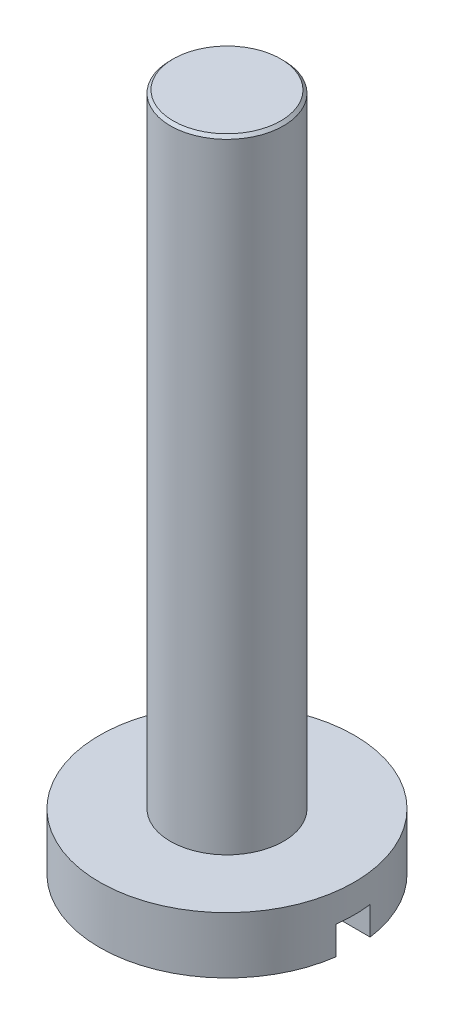
ISO-10303-21;
HEADER;
FILE_DESCRIPTION(('STEP AP214'),'2;1');
FILE_NAME('part.step','',(''),(''),'','','');
FILE_SCHEMA(('AUTOMOTIVE_DESIGN { 1 0 10303 214 1 1 1 1 }'));
ENDSEC;
DATA;
#1=APPLICATION_CONTEXT('core data for automotive mechanical design processes');
#2=APPLICATION_PROTOCOL_DEFINITION('international standard','automotive_design',2000,#1);
#3=PRODUCT_CONTEXT('',#1,'mechanical');
#4=PRODUCT('Part','Part','',(#3));
#5=PRODUCT_RELATED_PRODUCT_CATEGORY('part','',(#4));
#6=PRODUCT_DEFINITION_FORMATION('','',#4);
#7=PRODUCT_DEFINITION_CONTEXT('part definition',#1,'design');
#8=PRODUCT_DEFINITION('design','',#6,#7);
#9=PRODUCT_DEFINITION_SHAPE('','',#8);
#10=(LENGTH_UNIT() NAMED_UNIT(*) SI_UNIT(.MILLI.,.METRE.));
#11=(NAMED_UNIT(*) PLANE_ANGLE_UNIT() SI_UNIT($,.RADIAN.));
#12=(NAMED_UNIT(*) SI_UNIT($,.STERADIAN.) SOLID_ANGLE_UNIT());
#13=UNCERTAINTY_MEASURE_WITH_UNIT(LENGTH_MEASURE(1.E-05),#10,'distance_accuracy_value','');
#14=(GEOMETRIC_REPRESENTATION_CONTEXT(3) GLOBAL_UNCERTAINTY_ASSIGNED_CONTEXT((#13)) GLOBAL_UNIT_ASSIGNED_CONTEXT((#10,
#11,#12)) REPRESENTATION_CONTEXT('',''));
#15=CARTESIAN_POINT('',(0.,0.,0.));
#16=DIRECTION('',(0.,0.,1.));
#17=DIRECTION('',(1.,0.,0.));
#18=AXIS2_PLACEMENT_3D('',#15,#16,#17);
#19=CARTESIAN_POINT('',(0.,-1.,0.));
#20=DIRECTION('',(0.,-1.,0.));
#21=DIRECTION('',(0.,0.,-1.));
#22=AXIS2_PLACEMENT_3D('',#19,#20,#21);
#23=PLANE('',#22);
#24=DIRECTION('',(1.,0.,0.));
#25=VECTOR('',#24,1.);
#26=CARTESIAN_POINT('',(0.,-1.,-0.3));
#27=LINE('',#26,#25);
#28=CARTESIAN_POINT('',(-2.22991031209778,-1.,-0.3));
#29=VERTEX_POINT('',#28);
#30=CARTESIAN_POINT('',(2.22991031209778,-1.,-0.3));
#31=VERTEX_POINT('',#30);
#32=EDGE_CURVE('E91',#29,#31,#27,.T.);
#33=ORIENTED_EDGE('',*,*,#32,.F.);
#34=CARTESIAN_POINT('',(0.,-1.,0.));
#35=DIRECTION('',(0.,-1.,0.));
#36=DIRECTION('',(0.,0.,-1.));
#37=AXIS2_PLACEMENT_3D('',#34,#35,#36);
#38=CIRCLE('',#37,2.25);
#39=EDGE_CURVE('E101',#29,#31,#38,.T.);
#40=ORIENTED_EDGE('',*,*,#39,.T.);
#41=EDGE_LOOP('',(#33,#40));
#42=FACE_BOUND('',#41,.T.);
#43=ADVANCED_FACE('F43',(#42),#23,.T.);
#44=CARTESIAN_POINT('',(0.,-1.,0.));
#45=DIRECTION('',(0.,1.,0.));
#46=DIRECTION('',(0.,0.,1.));
#47=AXIS2_PLACEMENT_3D('',#44,#45,#46);
#48=CYLINDRICAL_SURFACE('',#47,2.25);
#49=CARTESIAN_POINT('',(0.,-0.5,0.));
#50=DIRECTION('',(0.,1.,0.));
#51=DIRECTION('',(0.,0.,1.));
#52=AXIS2_PLACEMENT_3D('',#49,#50,#51);
#53=CIRCLE('',#52,2.25);
#54=CARTESIAN_POINT('',(2.22991031209778,-0.5,0.3));
#55=VERTEX_POINT('',#54);
#56=CARTESIAN_POINT('',(2.22991031209778,-0.5,-0.3));
#57=VERTEX_POINT('',#56);
#58=EDGE_CURVE('E12',#55,#57,#53,.T.);
#59=ORIENTED_EDGE('',*,*,#58,.T.);
#60=DIRECTION('',(0.,1.,0.));
#61=VECTOR('',#60,1.);
#62=CARTESIAN_POINT('',(2.22991031209778,-1.,-0.3));
#63=LINE('',#62,#61);
#64=EDGE_CURVE('E66',#57,#31,#63,.F.);
#65=ORIENTED_EDGE('',*,*,#64,.T.);
#66=ORIENTED_EDGE('',*,*,#39,.F.);
#67=DIRECTION('',(0.,1.,0.));
#68=VECTOR('',#67,1.);
#69=CARTESIAN_POINT('',(-2.22991031209778,-1.,-0.3));
#70=LINE('',#69,#68);
#71=CARTESIAN_POINT('',(-2.22991031209778,-0.5,-0.3));
#72=VERTEX_POINT('',#71);
#73=EDGE_CURVE('E107',#29,#72,#70,.T.);
#74=ORIENTED_EDGE('',*,*,#73,.T.);
#75=CARTESIAN_POINT('',(-2.22991031209778,-0.5,0.3));
#76=VERTEX_POINT('',#75);
#77=EDGE_CURVE('E47',#72,#76,#53,.T.);
#78=ORIENTED_EDGE('',*,*,#77,.T.);
#79=DIRECTION('',(0.,1.,0.));
#80=VECTOR('',#79,1.);
#81=CARTESIAN_POINT('',(-2.22991031209778,-1.,0.3));
#82=LINE('',#81,#80);
#83=CARTESIAN_POINT('',(-2.22991031209778,-1.,0.3));
#84=VERTEX_POINT('',#83);
#85=EDGE_CURVE('E86',#76,#84,#82,.F.);
#86=ORIENTED_EDGE('',*,*,#85,.T.);
#87=CARTESIAN_POINT('',(2.22991031209778,-1.,0.3));
#88=VERTEX_POINT('',#87);
#89=EDGE_CURVE('E92',#88,#84,#38,.T.);
#90=ORIENTED_EDGE('',*,*,#89,.F.);
#91=DIRECTION('',(0.,1.,0.));
#92=VECTOR('',#91,1.);
#93=CARTESIAN_POINT('',(2.22991031209778,-1.,0.3));
#94=LINE('',#93,#92);
#95=EDGE_CURVE('E58',#88,#55,#94,.T.);
#96=ORIENTED_EDGE('',*,*,#95,.T.);
#97=EDGE_LOOP('',(#59,#65,#66,#74,#78,#86,#90,#96));
#98=FACE_BOUND('',#97,.T.);
#99=CARTESIAN_POINT('',(0.,0.,0.));
#100=DIRECTION('',(0.,-1.,0.));
#101=DIRECTION('',(0.,0.,-1.));
#102=AXIS2_PLACEMENT_3D('',#99,#100,#101);
#103=CIRCLE('',#102,2.25);
#104=CARTESIAN_POINT('',(0.,0.,-2.25));
#105=VERTEX_POINT('',#104);
#106=EDGE_CURVE('E104',#105,#105,#103,.T.);
#107=ORIENTED_EDGE('',*,*,#106,.T.);
#108=EDGE_LOOP('',(#107));
#109=FACE_BOUND('',#108,.T.);
#110=ADVANCED_FACE('F45',(#98,#109),#48,.T.);
#111=DIRECTION('',(-1.,0.,0.));
#112=VECTOR('',#111,1.);
#113=CARTESIAN_POINT('',(0.,-1.,0.3));
#114=LINE('',#113,#112);
#115=EDGE_CURVE('E83',#88,#84,#114,.T.);
#116=ORIENTED_EDGE('',*,*,#115,.F.);
#117=ORIENTED_EDGE('',*,*,#89,.T.);
#118=EDGE_LOOP('',(#116,#117));
#119=FACE_BOUND('',#118,.T.);
#120=ADVANCED_FACE('F100',(#119),#23,.T.);
#121=CARTESIAN_POINT('',(0.,0.,0.));
#122=DIRECTION('',(0.,-1.,0.));
#123=DIRECTION('',(0.,0.,-1.));
#124=AXIS2_PLACEMENT_3D('',#121,#122,#123);
#125=PLANE('',#124);
#126=ORIENTED_EDGE('',*,*,#106,.F.);
#127=EDGE_LOOP('',(#126));
#128=FACE_BOUND('',#127,.T.);
#129=ADVANCED_FACE('F121',(#128),#125,.F.);
#130=CARTESIAN_POINT('',(0.,-0.5,0.));
#131=DIRECTION('',(0.,1.,0.));
#132=DIRECTION('',(0.,0.,1.));
#133=AXIS2_PLACEMENT_3D('',#130,#131,#132);
#134=PLANE('',#133);
#135=DIRECTION('',(-1.,0.,0.));
#136=VECTOR('',#135,1.);
#137=CARTESIAN_POINT('',(-4.09817586391625,-0.5,0.3));
#138=LINE('',#137,#136);
#139=EDGE_CURVE('E172',#55,#76,#138,.T.);
#140=ORIENTED_EDGE('',*,*,#139,.T.);
#141=ORIENTED_EDGE('',*,*,#77,.F.);
#142=DIRECTION('',(1.,0.,0.));
#143=VECTOR('',#142,1.);
#144=CARTESIAN_POINT('',(-4.09817586391625,-0.5,-0.3));
#145=LINE('',#144,#143);
#146=EDGE_CURVE('E98',#72,#57,#145,.T.);
#147=ORIENTED_EDGE('',*,*,#146,.T.);
#148=ORIENTED_EDGE('',*,*,#58,.F.);
#149=EDGE_LOOP('',(#140,#141,#147,#148));
#150=FACE_BOUND('',#149,.T.);
#151=ADVANCED_FACE('F125',(#150),#134,.F.);
#152=CARTESIAN_POINT('',(-4.09817586391625,-0.5,-0.3));
#153=DIRECTION('',(0.,0.,-1.));
#154=DIRECTION('',(-1.,0.,0.));
#155=AXIS2_PLACEMENT_3D('',#152,#153,#154);
#156=PLANE('',#155);
#157=ORIENTED_EDGE('',*,*,#32,.T.);
#158=ORIENTED_EDGE('',*,*,#64,.F.);
#159=ORIENTED_EDGE('',*,*,#146,.F.);
#160=ORIENTED_EDGE('',*,*,#73,.F.);
#161=EDGE_LOOP('',(#157,#158,#159,#160));
#162=FACE_BOUND('',#161,.T.);
#163=ADVANCED_FACE('F111',(#162),#156,.F.);
#164=CARTESIAN_POINT('',(-4.09817586391625,-0.5,0.3));
#165=DIRECTION('',(0.,0.,1.));
#166=DIRECTION('',(1.,0.,0.));
#167=AXIS2_PLACEMENT_3D('',#164,#165,#166);
#168=PLANE('',#167);
#169=ORIENTED_EDGE('',*,*,#115,.T.);
#170=ORIENTED_EDGE('',*,*,#85,.F.);
#171=ORIENTED_EDGE('',*,*,#139,.F.);
#172=ORIENTED_EDGE('',*,*,#95,.F.);
#173=EDGE_LOOP('',(#169,#170,#171,#172));
#174=FACE_BOUND('',#173,.T.);
#175=ADVANCED_FACE('F85',(#174),#168,.F.);
#176=CLOSED_SHELL('',(#43,#110,#120,#129,#151,#163,#175));
#177=MANIFOLD_SOLID_BREP('B2',#176);
#178=CARTESIAN_POINT('',(0.,11.,0.));
#179=DIRECTION('',(0.,-1.,0.));
#180=DIRECTION('',(0.,0.,-1.));
#181=AXIS2_PLACEMENT_3D('',#178,#179,#180);
#182=CYLINDRICAL_SURFACE('',#181,1.);
#183=CARTESIAN_POINT('',(0.,10.95,0.));
#184=DIRECTION('',(0.,1.,0.));
#185=DIRECTION('',(0.,0.,1.));
#186=AXIS2_PLACEMENT_3D('',#183,#184,#185);
#187=CIRCLE('',#186,1.);
#188=CARTESIAN_POINT('',(0.,10.95,1.));
#189=VERTEX_POINT('',#188);
#190=EDGE_CURVE('E42',#189,#189,#187,.F.);
#191=ORIENTED_EDGE('',*,*,#190,.T.);
#192=EDGE_LOOP('',(#191));
#193=FACE_BOUND('',#192,.T.);
#194=CARTESIAN_POINT('',(0.,0.,0.));
#195=DIRECTION('',(0.,1.,0.));
#196=DIRECTION('',(0.,0.,1.));
#197=AXIS2_PLACEMENT_3D('',#194,#195,#196);
#198=CIRCLE('',#197,1.);
#199=CARTESIAN_POINT('',(0.,0.,1.));
#200=VERTEX_POINT('',#199);
#201=EDGE_CURVE('E190',#200,#200,#198,.T.);
#202=ORIENTED_EDGE('',*,*,#201,.T.);
#203=EDGE_LOOP('',(#202));
#204=FACE_BOUND('',#203,.T.);
#205=ADVANCED_FACE('F179',(#193,#204),#182,.T.);
#206=CARTESIAN_POINT('',(0.,11.,0.));
#207=DIRECTION('',(0.,1.,0.));
#208=DIRECTION('',(0.,0.,1.));
#209=AXIS2_PLACEMENT_3D('',#206,#207,#208);
#210=PLANE('',#209);
#211=CARTESIAN_POINT('',(0.,11.,0.));
#212=DIRECTION('',(0.,1.,0.));
#213=DIRECTION('',(0.,0.,1.));
#214=AXIS2_PLACEMENT_3D('',#211,#212,#213);
#215=CIRCLE('',#214,0.949999999999998);
#216=CARTESIAN_POINT('',(0.,11.,0.949999999999998));
#217=VERTEX_POINT('',#216);
#218=EDGE_CURVE('E186',#217,#217,#215,.T.);
#219=ORIENTED_EDGE('',*,*,#218,.T.);
#220=EDGE_LOOP('',(#219));
#221=FACE_BOUND('',#220,.T.);
#222=ADVANCED_FACE('F200',(#221),#210,.T.);
#223=CARTESIAN_POINT('',(0.,0.,0.));
#224=DIRECTION('',(0.,1.,0.));
#225=DIRECTION('',(0.,0.,1.));
#226=AXIS2_PLACEMENT_3D('',#223,#224,#225);
#227=PLANE('',#226);
#228=ORIENTED_EDGE('',*,*,#201,.F.);
#229=EDGE_LOOP('',(#228));
#230=FACE_BOUND('',#229,.T.);
#231=ADVANCED_FACE('F198',(#230),#227,.F.);
#232=CARTESIAN_POINT('',(0.,11.,0.));
#233=DIRECTION('',(0.,-1.,0.));
#234=DIRECTION('',(0.,0.,-1.));
#235=AXIS2_PLACEMENT_3D('',#232,#233,#234);
#236=CONICAL_SURFACE('',#235,0.949999999999998,0.785398163397457);
#237=ORIENTED_EDGE('',*,*,#190,.F.);
#238=EDGE_LOOP('',(#237));
#239=FACE_BOUND('',#238,.T.);
#240=ORIENTED_EDGE('',*,*,#218,.F.);
#241=EDGE_LOOP('',(#240));
#242=FACE_BOUND('',#241,.T.);
#243=ADVANCED_FACE('F181',(#239,#242),#236,.T.);
#244=CLOSED_SHELL('',(#205,#222,#231,#243));
#245=MANIFOLD_SOLID_BREP('B6',#244);
#246=ADVANCED_BREP_SHAPE_REPRESENTATION('',(#18,#177,#245),#14);
#247=SHAPE_DEFINITION_REPRESENTATION(#9,#246);
ENDSEC;
END-ISO-10303-21;
